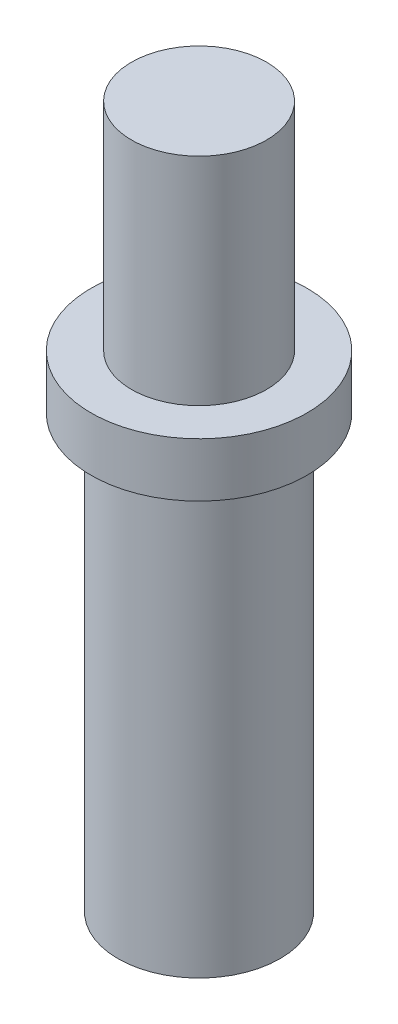
ISO-10303-21;
HEADER;
FILE_DESCRIPTION(('STEP AP214'),'2;1');
FILE_NAME('part.step','',(''),(''),'','','');
FILE_SCHEMA(('AUTOMOTIVE_DESIGN { 1 0 10303 214 1 1 1 1 }'));
ENDSEC;
DATA;
#1=APPLICATION_CONTEXT('core data for automotive mechanical design processes');
#2=APPLICATION_PROTOCOL_DEFINITION('international standard','automotive_design',2000,#1);
#3=PRODUCT_CONTEXT('',#1,'mechanical');
#4=PRODUCT('Part','Part','',(#3));
#5=PRODUCT_RELATED_PRODUCT_CATEGORY('part','',(#4));
#6=PRODUCT_DEFINITION_FORMATION('','',#4);
#7=PRODUCT_DEFINITION_CONTEXT('part definition',#1,'design');
#8=PRODUCT_DEFINITION('design','',#6,#7);
#9=PRODUCT_DEFINITION_SHAPE('','',#8);
#10=(LENGTH_UNIT() NAMED_UNIT(*) SI_UNIT(.MILLI.,.METRE.));
#11=(NAMED_UNIT(*) PLANE_ANGLE_UNIT() SI_UNIT($,.RADIAN.));
#12=(NAMED_UNIT(*) SI_UNIT($,.STERADIAN.) SOLID_ANGLE_UNIT());
#13=UNCERTAINTY_MEASURE_WITH_UNIT(LENGTH_MEASURE(1.E-05),#10,'distance_accuracy_value','');
#14=(GEOMETRIC_REPRESENTATION_CONTEXT(3) GLOBAL_UNCERTAINTY_ASSIGNED_CONTEXT((#13)) GLOBAL_UNIT_ASSIGNED_CONTEXT((#10,
#11,#12)) REPRESENTATION_CONTEXT('',''));
#15=CARTESIAN_POINT('',(0.,0.,0.));
#16=DIRECTION('',(0.,0.,1.));
#17=DIRECTION('',(1.,0.,0.));
#18=AXIS2_PLACEMENT_3D('',#15,#16,#17);
#19=CARTESIAN_POINT('',(3.,27.2296979865772,0.));
#20=DIRECTION('',(0.,-1.,0.));
#21=DIRECTION('',(0.,0.,-1.));
#22=AXIS2_PLACEMENT_3D('',#19,#20,#21);
#23=PLANE('',#22);
#24=CARTESIAN_POINT('',(0.,27.2296979865772,0.));
#25=DIRECTION('',(0.,-1.,0.));
#26=DIRECTION('',(0.,0.,-1.));
#27=AXIS2_PLACEMENT_3D('',#24,#25,#26);
#28=CIRCLE('',#27,4.);
#29=CARTESIAN_POINT('',(0.,27.2296979865772,-4.));
#30=VERTEX_POINT('',#29);
#31=EDGE_CURVE('E10',#30,#30,#28,.T.);
#32=ORIENTED_EDGE('',*,*,#31,.T.);
#33=EDGE_LOOP('',(#32));
#34=FACE_BOUND('',#33,.T.);
#35=CARTESIAN_POINT('',(0.,27.2296979865772,0.));
#36=DIRECTION('',(0.,-1.,0.));
#37=DIRECTION('',(0.,0.,-1.));
#38=AXIS2_PLACEMENT_3D('',#35,#36,#37);
#39=CIRCLE('',#38,3.);
#40=CARTESIAN_POINT('',(0.,27.2296979865772,-3.));
#41=VERTEX_POINT('',#40);
#42=EDGE_CURVE('E56',#41,#41,#39,.T.);
#43=ORIENTED_EDGE('',*,*,#42,.F.);
#44=EDGE_LOOP('',(#43));
#45=FACE_BOUND('',#44,.T.);
#46=ADVANCED_FACE('F28',(#34,#45),#23,.T.);
#47=CARTESIAN_POINT('',(0.,0.,0.));
#48=DIRECTION('',(0.,-1.,0.));
#49=DIRECTION('',(0.,0.,-1.));
#50=AXIS2_PLACEMENT_3D('',#47,#48,#49);
#51=CYLINDRICAL_SURFACE('',#50,4.);
#52=CARTESIAN_POINT('',(0.,29.2296979865772,0.));
#53=DIRECTION('',(0.,-1.,0.));
#54=DIRECTION('',(0.,0.,-1.));
#55=AXIS2_PLACEMENT_3D('',#52,#53,#54);
#56=CIRCLE('',#55,4.);
#57=CARTESIAN_POINT('',(0.,29.2296979865772,-4.));
#58=VERTEX_POINT('',#57);
#59=EDGE_CURVE('E34',#58,#58,#56,.T.);
#60=ORIENTED_EDGE('',*,*,#59,.T.);
#61=EDGE_LOOP('',(#60));
#62=FACE_BOUND('',#61,.T.);
#63=ORIENTED_EDGE('',*,*,#31,.F.);
#64=EDGE_LOOP('',(#63));
#65=FACE_BOUND('',#64,.T.);
#66=ADVANCED_FACE('F64',(#62,#65),#51,.T.);
#67=CARTESIAN_POINT('',(2.5,29.2296979865772,0.));
#68=DIRECTION('',(0.,1.,0.));
#69=DIRECTION('',(0.,0.,1.));
#70=AXIS2_PLACEMENT_3D('',#67,#68,#69);
#71=PLANE('',#70);
#72=CARTESIAN_POINT('',(0.,29.2296979865772,0.));
#73=DIRECTION('',(0.,-1.,0.));
#74=DIRECTION('',(0.,0.,-1.));
#75=AXIS2_PLACEMENT_3D('',#72,#73,#74);
#76=CIRCLE('',#75,2.5);
#77=CARTESIAN_POINT('',(0.,29.2296979865772,-2.5));
#78=VERTEX_POINT('',#77);
#79=EDGE_CURVE('E38',#78,#78,#76,.T.);
#80=ORIENTED_EDGE('',*,*,#79,.T.);
#81=EDGE_LOOP('',(#80));
#82=FACE_BOUND('',#81,.T.);
#83=ORIENTED_EDGE('',*,*,#59,.F.);
#84=EDGE_LOOP('',(#83));
#85=FACE_BOUND('',#84,.T.);
#86=ADVANCED_FACE('F68',(#82,#85),#71,.T.);
#87=CARTESIAN_POINT('',(0.,0.,0.));
#88=DIRECTION('',(0.,-1.,0.));
#89=DIRECTION('',(0.,0.,-1.));
#90=AXIS2_PLACEMENT_3D('',#87,#88,#89);
#91=CYLINDRICAL_SURFACE('',#90,2.5);
#92=CARTESIAN_POINT('',(0.,37.2296979865772,0.));
#93=DIRECTION('',(0.,-1.,0.));
#94=DIRECTION('',(0.,0.,-1.));
#95=AXIS2_PLACEMENT_3D('',#92,#93,#94);
#96=CIRCLE('',#95,2.5);
#97=CARTESIAN_POINT('',(0.,37.2296979865772,-2.5));
#98=VERTEX_POINT('',#97);
#99=EDGE_CURVE('E42',#98,#98,#96,.T.);
#100=ORIENTED_EDGE('',*,*,#99,.T.);
#101=EDGE_LOOP('',(#100));
#102=FACE_BOUND('',#101,.T.);
#103=ORIENTED_EDGE('',*,*,#79,.F.);
#104=EDGE_LOOP('',(#103));
#105=FACE_BOUND('',#104,.T.);
#106=ADVANCED_FACE('F72',(#102,#105),#91,.T.);
#107=CARTESIAN_POINT('',(0.,37.2296979865772,0.));
#108=DIRECTION('',(0.,1.,0.));
#109=DIRECTION('',(0.,0.,1.));
#110=AXIS2_PLACEMENT_3D('',#107,#108,#109);
#111=PLANE('',#110);
#112=ORIENTED_EDGE('',*,*,#99,.F.);
#113=EDGE_LOOP('',(#112));
#114=FACE_BOUND('',#113,.T.);
#115=ADVANCED_FACE('F79',(#114),#111,.T.);
#116=CARTESIAN_POINT('',(0.,26.2296979865772,0.));
#117=DIRECTION('',(0.,-1.,0.));
#118=DIRECTION('',(0.,0.,-1.));
#119=AXIS2_PLACEMENT_3D('',#116,#117,#118);
#120=PLANE('',#119);
#121=CARTESIAN_POINT('',(0.,26.2296979865772,0.));
#122=DIRECTION('',(0.,-1.,0.));
#123=DIRECTION('',(0.,0.,-1.));
#124=AXIS2_PLACEMENT_3D('',#121,#122,#123);
#125=CIRCLE('',#124,2.);
#126=CARTESIAN_POINT('',(0.,26.2296979865772,-2.));
#127=VERTEX_POINT('',#126);
#128=EDGE_CURVE('E47',#127,#127,#125,.T.);
#129=ORIENTED_EDGE('',*,*,#128,.T.);
#130=EDGE_LOOP('',(#129));
#131=FACE_BOUND('',#130,.T.);
#132=ADVANCED_FACE('F83',(#131),#120,.T.);
#133=CARTESIAN_POINT('',(0.,0.,0.));
#134=DIRECTION('',(0.,-1.,0.));
#135=DIRECTION('',(0.,0.,-1.));
#136=AXIS2_PLACEMENT_3D('',#133,#134,#135);
#137=CYLINDRICAL_SURFACE('',#136,2.);
#138=CARTESIAN_POINT('',(0.,11.2296979865772,0.));
#139=DIRECTION('',(0.,-1.,0.));
#140=DIRECTION('',(0.,0.,-1.));
#141=AXIS2_PLACEMENT_3D('',#138,#139,#140);
#142=CIRCLE('',#141,2.);
#143=CARTESIAN_POINT('',(0.,11.2296979865772,-2.));
#144=VERTEX_POINT('',#143);
#145=EDGE_CURVE('E50',#144,#144,#142,.T.);
#146=ORIENTED_EDGE('',*,*,#145,.T.);
#147=EDGE_LOOP('',(#146));
#148=FACE_BOUND('',#147,.T.);
#149=ORIENTED_EDGE('',*,*,#128,.F.);
#150=EDGE_LOOP('',(#149));
#151=FACE_BOUND('',#150,.T.);
#152=ADVANCED_FACE('F87',(#148,#151),#137,.F.);
#153=CARTESIAN_POINT('',(2.,11.2296979865772,0.));
#154=DIRECTION('',(0.,-1.,0.));
#155=DIRECTION('',(0.,0.,-1.));
#156=AXIS2_PLACEMENT_3D('',#153,#154,#155);
#157=PLANE('',#156);
#158=CARTESIAN_POINT('',(0.,11.2296979865772,0.));
#159=DIRECTION('',(0.,-1.,0.));
#160=DIRECTION('',(0.,0.,-1.));
#161=AXIS2_PLACEMENT_3D('',#158,#159,#160);
#162=CIRCLE('',#161,3.);
#163=CARTESIAN_POINT('',(0.,11.2296979865772,-3.));
#164=VERTEX_POINT('',#163);
#165=EDGE_CURVE('E53',#164,#164,#162,.T.);
#166=ORIENTED_EDGE('',*,*,#165,.T.);
#167=EDGE_LOOP('',(#166));
#168=FACE_BOUND('',#167,.T.);
#169=ORIENTED_EDGE('',*,*,#145,.F.);
#170=EDGE_LOOP('',(#169));
#171=FACE_BOUND('',#170,.T.);
#172=ADVANCED_FACE('F91',(#168,#171),#157,.T.);
#173=CARTESIAN_POINT('',(0.,0.,0.));
#174=DIRECTION('',(0.,-1.,0.));
#175=DIRECTION('',(0.,0.,-1.));
#176=AXIS2_PLACEMENT_3D('',#173,#174,#175);
#177=CYLINDRICAL_SURFACE('',#176,3.);
#178=ORIENTED_EDGE('',*,*,#42,.T.);
#179=EDGE_LOOP('',(#178));
#180=FACE_BOUND('',#179,.T.);
#181=ORIENTED_EDGE('',*,*,#165,.F.);
#182=EDGE_LOOP('',(#181));
#183=FACE_BOUND('',#182,.T.);
#184=ADVANCED_FACE('F60',(#180,#183),#177,.T.);
#185=CLOSED_SHELL('',(#46,#66,#86,#106,#115,#132,#152,#172,#184));
#186=MANIFOLD_SOLID_BREP('B2',#185);
#187=ADVANCED_BREP_SHAPE_REPRESENTATION('',(#18,#186),#14);
#188=SHAPE_DEFINITION_REPRESENTATION(#9,#187);
ENDSEC;
END-ISO-10303-21;
